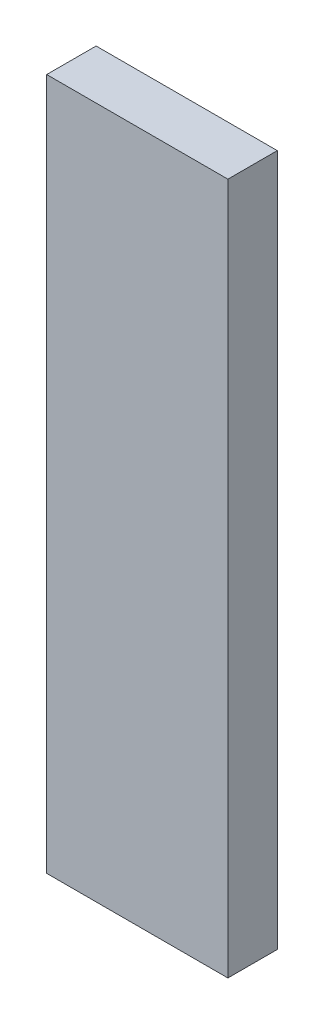
ISO-10303-21;
HEADER;
FILE_DESCRIPTION(('STEP AP214'),'2;1');
FILE_NAME('part.step','',(''),(''),'','','');
FILE_SCHEMA(('AUTOMOTIVE_DESIGN { 1 0 10303 214 1 1 1 1 }'));
ENDSEC;
DATA;
#1=APPLICATION_CONTEXT('core data for automotive mechanical design processes');
#2=APPLICATION_PROTOCOL_DEFINITION('international standard','automotive_design',2000,#1);
#3=PRODUCT_CONTEXT('',#1,'mechanical');
#4=PRODUCT('Part','Part','',(#3));
#5=PRODUCT_RELATED_PRODUCT_CATEGORY('part','',(#4));
#6=PRODUCT_DEFINITION_FORMATION('','',#4);
#7=PRODUCT_DEFINITION_CONTEXT('part definition',#1,'design');
#8=PRODUCT_DEFINITION('design','',#6,#7);
#9=PRODUCT_DEFINITION_SHAPE('','',#8);
#10=(LENGTH_UNIT() NAMED_UNIT(*) SI_UNIT(.MILLI.,.METRE.));
#11=(NAMED_UNIT(*) PLANE_ANGLE_UNIT() SI_UNIT($,.RADIAN.));
#12=(NAMED_UNIT(*) SI_UNIT($,.STERADIAN.) SOLID_ANGLE_UNIT());
#13=UNCERTAINTY_MEASURE_WITH_UNIT(LENGTH_MEASURE(1.E-05),#10,'distance_accuracy_value','');
#14=(GEOMETRIC_REPRESENTATION_CONTEXT(3) GLOBAL_UNCERTAINTY_ASSIGNED_CONTEXT((#13)) GLOBAL_UNIT_ASSIGNED_CONTEXT((#10,
#11,#12)) REPRESENTATION_CONTEXT('',''));
#15=CARTESIAN_POINT('',(0.,0.,0.));
#16=DIRECTION('',(0.,0.,1.));
#17=DIRECTION('',(1.,0.,0.));
#18=AXIS2_PLACEMENT_3D('',#15,#16,#17);
#19=CARTESIAN_POINT('',(-69.85,533.4,19.05));
#20=DIRECTION('',(-1.,0.,0.));
#21=DIRECTION('',(0.,0.,1.));
#22=AXIS2_PLACEMENT_3D('',#19,#20,#21);
#23=PLANE('',#22);
#24=DIRECTION('',(0.,0.,-1.));
#25=VECTOR('',#24,1.);
#26=CARTESIAN_POINT('',(-69.85,0.,19.05));
#27=LINE('',#26,#25);
#28=CARTESIAN_POINT('',(-69.85,0.,19.05));
#29=VERTEX_POINT('',#28);
#30=CARTESIAN_POINT('',(-69.85,0.,-19.05));
#31=VERTEX_POINT('',#30);
#32=EDGE_CURVE('E102',#29,#31,#27,.T.);
#33=ORIENTED_EDGE('',*,*,#32,.F.);
#34=DIRECTION('',(0.,-1.,0.));
#35=VECTOR('',#34,1.);
#36=CARTESIAN_POINT('',(-69.85,533.4,19.05));
#37=LINE('',#36,#35);
#38=CARTESIAN_POINT('',(-69.85,533.4,19.05));
#39=VERTEX_POINT('',#38);
#40=EDGE_CURVE('E11',#39,#29,#37,.T.);
#41=ORIENTED_EDGE('',*,*,#40,.F.);
#42=DIRECTION('',(0.,0.,-1.));
#43=VECTOR('',#42,1.);
#44=CARTESIAN_POINT('',(-69.85,533.4,19.05));
#45=LINE('',#44,#43);
#46=CARTESIAN_POINT('',(-69.85,533.4,-19.05));
#47=VERTEX_POINT('',#46);
#48=EDGE_CURVE('E97',#39,#47,#45,.T.);
#49=ORIENTED_EDGE('',*,*,#48,.T.);
#50=DIRECTION('',(0.,-1.,0.));
#51=VECTOR('',#50,1.);
#52=CARTESIAN_POINT('',(-69.85,533.4,-19.05));
#53=LINE('',#52,#51);
#54=EDGE_CURVE('E40',#47,#31,#53,.T.);
#55=ORIENTED_EDGE('',*,*,#54,.T.);
#56=EDGE_LOOP('',(#33,#41,#49,#55));
#57=FACE_BOUND('',#56,.T.);
#58=ADVANCED_FACE('F37',(#57),#23,.T.);
#59=CARTESIAN_POINT('',(-69.85,533.4,19.05));
#60=DIRECTION('',(0.,0.,-1.));
#61=DIRECTION('',(-1.,0.,0.));
#62=AXIS2_PLACEMENT_3D('',#59,#60,#61);
#63=PLANE('',#62);
#64=DIRECTION('',(1.,0.,0.));
#65=VECTOR('',#64,1.);
#66=CARTESIAN_POINT('',(-69.85,0.,19.05));
#67=LINE('',#66,#65);
#68=CARTESIAN_POINT('',(69.85,0.,19.05));
#69=VERTEX_POINT('',#68);
#70=EDGE_CURVE('E70',#29,#69,#67,.T.);
#71=ORIENTED_EDGE('',*,*,#70,.T.);
#72=DIRECTION('',(0.,-1.,0.));
#73=VECTOR('',#72,1.);
#74=CARTESIAN_POINT('',(69.85,533.4,19.05));
#75=LINE('',#74,#73);
#76=CARTESIAN_POINT('',(69.85,533.4,19.05));
#77=VERTEX_POINT('',#76);
#78=EDGE_CURVE('E46',#77,#69,#75,.T.);
#79=ORIENTED_EDGE('',*,*,#78,.F.);
#80=DIRECTION('',(1.,0.,0.));
#81=VECTOR('',#80,1.);
#82=CARTESIAN_POINT('',(-69.85,533.4,19.05));
#83=LINE('',#82,#81);
#84=EDGE_CURVE('E87',#39,#77,#83,.T.);
#85=ORIENTED_EDGE('',*,*,#84,.F.);
#86=ORIENTED_EDGE('',*,*,#40,.T.);
#87=EDGE_LOOP('',(#71,#79,#85,#86));
#88=FACE_BOUND('',#87,.T.);
#89=ADVANCED_FACE('F112',(#88),#63,.F.);
#90=CARTESIAN_POINT('',(69.85,533.4,19.05));
#91=DIRECTION('',(-1.,0.,0.));
#92=DIRECTION('',(0.,0.,1.));
#93=AXIS2_PLACEMENT_3D('',#90,#91,#92);
#94=PLANE('',#93);
#95=DIRECTION('',(0.,0.,-1.));
#96=VECTOR('',#95,1.);
#97=CARTESIAN_POINT('',(69.85,0.,19.05));
#98=LINE('',#97,#96);
#99=CARTESIAN_POINT('',(69.85,0.,-19.05));
#100=VERTEX_POINT('',#99);
#101=EDGE_CURVE('E94',#69,#100,#98,.T.);
#102=ORIENTED_EDGE('',*,*,#101,.T.);
#103=DIRECTION('',(0.,-1.,0.));
#104=VECTOR('',#103,1.);
#105=CARTESIAN_POINT('',(69.85,533.4,-19.05));
#106=LINE('',#105,#104);
#107=CARTESIAN_POINT('',(69.85,533.4,-19.05));
#108=VERTEX_POINT('',#107);
#109=EDGE_CURVE('E91',#108,#100,#106,.T.);
#110=ORIENTED_EDGE('',*,*,#109,.F.);
#111=DIRECTION('',(0.,0.,-1.));
#112=VECTOR('',#111,1.);
#113=CARTESIAN_POINT('',(69.85,533.4,19.05));
#114=LINE('',#113,#112);
#115=EDGE_CURVE('E82',#77,#108,#114,.T.);
#116=ORIENTED_EDGE('',*,*,#115,.F.);
#117=ORIENTED_EDGE('',*,*,#78,.T.);
#118=EDGE_LOOP('',(#102,#110,#116,#117));
#119=FACE_BOUND('',#118,.T.);
#120=ADVANCED_FACE('F92',(#119),#94,.F.);
#121=CARTESIAN_POINT('',(-69.85,533.4,-19.05));
#122=DIRECTION('',(0.,0.,-1.));
#123=DIRECTION('',(-1.,0.,0.));
#124=AXIS2_PLACEMENT_3D('',#121,#122,#123);
#125=PLANE('',#124);
#126=DIRECTION('',(1.,0.,0.));
#127=VECTOR('',#126,1.);
#128=CARTESIAN_POINT('',(-69.85,0.,-19.05));
#129=LINE('',#128,#127);
#130=EDGE_CURVE('E105',#31,#100,#129,.T.);
#131=ORIENTED_EDGE('',*,*,#130,.F.);
#132=ORIENTED_EDGE('',*,*,#54,.F.);
#133=DIRECTION('',(1.,0.,0.));
#134=VECTOR('',#133,1.);
#135=CARTESIAN_POINT('',(-69.85,533.4,-19.05));
#136=LINE('',#135,#134);
#137=EDGE_CURVE('E86',#47,#108,#136,.T.);
#138=ORIENTED_EDGE('',*,*,#137,.T.);
#139=ORIENTED_EDGE('',*,*,#109,.T.);
#140=EDGE_LOOP('',(#131,#132,#138,#139));
#141=FACE_BOUND('',#140,.T.);
#142=ADVANCED_FACE('F96',(#141),#125,.T.);
#143=CARTESIAN_POINT('',(0.,533.4,0.));
#144=DIRECTION('',(0.,-1.,0.));
#145=DIRECTION('',(0.,0.,-1.));
#146=AXIS2_PLACEMENT_3D('',#143,#144,#145);
#147=PLANE('',#146);
#148=ORIENTED_EDGE('',*,*,#48,.F.);
#149=ORIENTED_EDGE('',*,*,#84,.T.);
#150=ORIENTED_EDGE('',*,*,#115,.T.);
#151=ORIENTED_EDGE('',*,*,#137,.F.);
#152=EDGE_LOOP('',(#148,#149,#150,#151));
#153=FACE_BOUND('',#152,.T.);
#154=ADVANCED_FACE('F85',(#153),#147,.F.);
#155=CARTESIAN_POINT('',(0.,0.,0.));
#156=DIRECTION('',(0.,-1.,0.));
#157=DIRECTION('',(0.,0.,-1.));
#158=AXIS2_PLACEMENT_3D('',#155,#156,#157);
#159=PLANE('',#158);
#160=ORIENTED_EDGE('',*,*,#32,.T.);
#161=ORIENTED_EDGE('',*,*,#130,.T.);
#162=ORIENTED_EDGE('',*,*,#101,.F.);
#163=ORIENTED_EDGE('',*,*,#70,.F.);
#164=EDGE_LOOP('',(#160,#161,#162,#163));
#165=FACE_BOUND('',#164,.T.);
#166=ADVANCED_FACE('F110',(#165),#159,.T.);
#167=CLOSED_SHELL('',(#58,#89,#120,#142,#154,#166));
#168=MANIFOLD_SOLID_BREP('B2',#167);
#169=ADVANCED_BREP_SHAPE_REPRESENTATION('',(#18,#168),#14);
#170=SHAPE_DEFINITION_REPRESENTATION(#9,#169);
ENDSEC;
END-ISO-10303-21;
